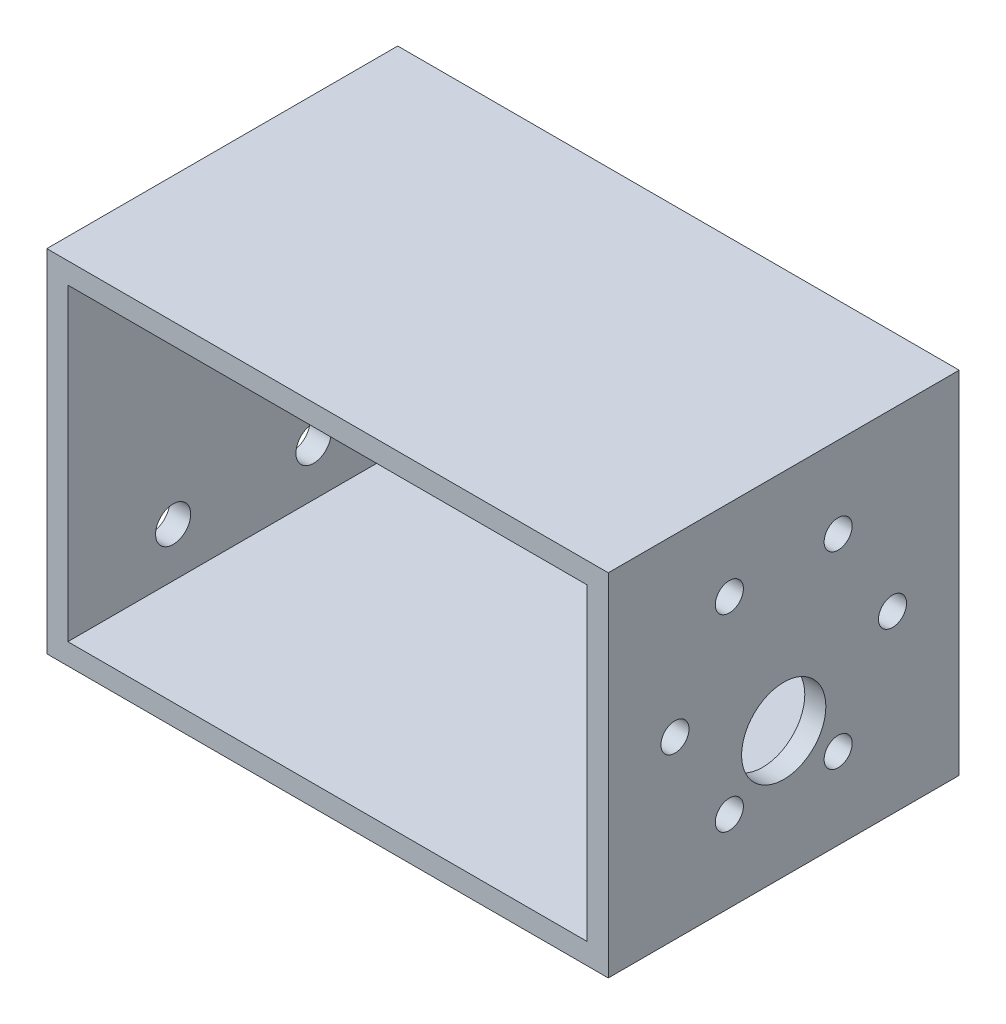
ISO-10303-21;
HEADER;
FILE_DESCRIPTION(('STEP AP214'),'2;1');
FILE_NAME('part.step','',(''),(''),'','','');
FILE_SCHEMA(('AUTOMOTIVE_DESIGN { 1 0 10303 214 1 1 1 1 }'));
ENDSEC;
DATA;
#1=APPLICATION_CONTEXT('core data for automotive mechanical design processes');
#2=APPLICATION_PROTOCOL_DEFINITION('international standard','automotive_design',2000,#1);
#3=PRODUCT_CONTEXT('',#1,'mechanical');
#4=PRODUCT('Part','Part','',(#3));
#5=PRODUCT_RELATED_PRODUCT_CATEGORY('part','',(#4));
#6=PRODUCT_DEFINITION_FORMATION('','',#4);
#7=PRODUCT_DEFINITION_CONTEXT('part definition',#1,'design');
#8=PRODUCT_DEFINITION('design','',#6,#7);
#9=PRODUCT_DEFINITION_SHAPE('','',#8);
#10=(LENGTH_UNIT() NAMED_UNIT(*) SI_UNIT(.MILLI.,.METRE.));
#11=(NAMED_UNIT(*) PLANE_ANGLE_UNIT() SI_UNIT($,.RADIAN.));
#12=(NAMED_UNIT(*) SI_UNIT($,.STERADIAN.) SOLID_ANGLE_UNIT());
#13=UNCERTAINTY_MEASURE_WITH_UNIT(LENGTH_MEASURE(1.E-05),#10,'distance_accuracy_value','');
#14=(GEOMETRIC_REPRESENTATION_CONTEXT(3) GLOBAL_UNCERTAINTY_ASSIGNED_CONTEXT((#13)) GLOBAL_UNIT_ASSIGNED_CONTEXT((#10,
#11,#12)) REPRESENTATION_CONTEXT('',''));
#15=CARTESIAN_POINT('',(0.,0.,0.));
#16=DIRECTION('',(0.,0.,1.));
#17=DIRECTION('',(1.,0.,0.));
#18=AXIS2_PLACEMENT_3D('',#15,#16,#17);
#19=CARTESIAN_POINT('',(0.,0.,-50.));
#20=DIRECTION('',(0.,0.,1.));
#21=DIRECTION('',(1.,0.,0.));
#22=AXIS2_PLACEMENT_3D('',#19,#20,#21);
#23=PLANE('',#22);
#24=DIRECTION('',(0.,1.,0.));
#25=VECTOR('',#24,1.);
#26=CARTESIAN_POINT('',(0.,0.,-50.));
#27=LINE('',#26,#25);
#28=CARTESIAN_POINT('',(0.,-50.,-50.));
#29=VERTEX_POINT('',#28);
#30=CARTESIAN_POINT('',(0.,0.,-50.));
#31=VERTEX_POINT('',#30);
#32=EDGE_CURVE('E135',#29,#31,#27,.T.);
#33=ORIENTED_EDGE('',*,*,#32,.T.);
#34=DIRECTION('',(1.,0.,0.));
#35=VECTOR('',#34,1.);
#36=CARTESIAN_POINT('',(0.,0.,-50.));
#37=LINE('',#36,#35);
#38=CARTESIAN_POINT('',(80.,0.,-50.));
#39=VERTEX_POINT('',#38);
#40=EDGE_CURVE('E138',#31,#39,#37,.T.);
#41=ORIENTED_EDGE('',*,*,#40,.T.);
#42=DIRECTION('',(0.,-1.,0.));
#43=VECTOR('',#42,1.);
#44=CARTESIAN_POINT('',(80.,0.,-50.));
#45=LINE('',#44,#43);
#46=CARTESIAN_POINT('',(80.,-50.,-50.));
#47=VERTEX_POINT('',#46);
#48=EDGE_CURVE('E141',#39,#47,#45,.T.);
#49=ORIENTED_EDGE('',*,*,#48,.T.);
#50=DIRECTION('',(-1.,0.,0.));
#51=VECTOR('',#50,1.);
#52=CARTESIAN_POINT('',(0.,-50.,-50.));
#53=LINE('',#52,#51);
#54=EDGE_CURVE('E143',#47,#29,#53,.T.);
#55=ORIENTED_EDGE('',*,*,#54,.T.);
#56=EDGE_LOOP('',(#33,#41,#49,#55));
#57=FACE_BOUND('',#56,.T.);
#58=DIRECTION('',(0.,1.,0.));
#59=VECTOR('',#58,1.);
#60=CARTESIAN_POINT('',(3.,-3.,-50.));
#61=LINE('',#60,#59);
#62=CARTESIAN_POINT('',(3.,-47.,-50.));
#63=VERTEX_POINT('',#62);
#64=CARTESIAN_POINT('',(3.,-3.,-50.));
#65=VERTEX_POINT('',#64);
#66=EDGE_CURVE('E97',#63,#65,#61,.T.);
#67=ORIENTED_EDGE('',*,*,#66,.F.);
#68=DIRECTION('',(-1.,0.,0.));
#69=VECTOR('',#68,1.);
#70=CARTESIAN_POINT('',(3.,-47.,-50.));
#71=LINE('',#70,#69);
#72=CARTESIAN_POINT('',(77.,-47.,-50.));
#73=VERTEX_POINT('',#72);
#74=EDGE_CURVE('E119',#73,#63,#71,.T.);
#75=ORIENTED_EDGE('',*,*,#74,.F.);
#76=DIRECTION('',(0.,-1.,0.));
#77=VECTOR('',#76,1.);
#78=CARTESIAN_POINT('',(77.,-3.,-50.));
#79=LINE('',#78,#77);
#80=CARTESIAN_POINT('',(77.,-3.,-50.));
#81=VERTEX_POINT('',#80);
#82=EDGE_CURVE('E117',#81,#73,#79,.T.);
#83=ORIENTED_EDGE('',*,*,#82,.F.);
#84=DIRECTION('',(1.,0.,0.));
#85=VECTOR('',#84,1.);
#86=CARTESIAN_POINT('',(3.,-3.,-50.));
#87=LINE('',#86,#85);
#88=EDGE_CURVE('E105',#65,#81,#87,.T.);
#89=ORIENTED_EDGE('',*,*,#88,.F.);
#90=EDGE_LOOP('',(#67,#75,#83,#89));
#91=FACE_BOUND('',#90,.T.);
#92=ADVANCED_FACE('F32',(#57,#91),#23,.F.);
#93=CARTESIAN_POINT('',(0.,0.,0.));
#94=DIRECTION('',(0.,0.,1.));
#95=DIRECTION('',(1.,0.,0.));
#96=AXIS2_PLACEMENT_3D('',#93,#94,#95);
#97=PLANE('',#96);
#98=DIRECTION('',(0.,1.,0.));
#99=VECTOR('',#98,1.);
#100=CARTESIAN_POINT('',(0.,0.,0.));
#101=LINE('',#100,#99);
#102=CARTESIAN_POINT('',(0.,-50.,0.));
#103=VERTEX_POINT('',#102);
#104=CARTESIAN_POINT('',(0.,0.,0.));
#105=VERTEX_POINT('',#104);
#106=EDGE_CURVE('E113',#103,#105,#101,.T.);
#107=ORIENTED_EDGE('',*,*,#106,.F.);
#108=DIRECTION('',(-1.,0.,0.));
#109=VECTOR('',#108,1.);
#110=CARTESIAN_POINT('',(0.,-50.,0.));
#111=LINE('',#110,#109);
#112=CARTESIAN_POINT('',(80.,-50.,0.));
#113=VERTEX_POINT('',#112);
#114=EDGE_CURVE('E139',#113,#103,#111,.T.);
#115=ORIENTED_EDGE('',*,*,#114,.F.);
#116=DIRECTION('',(0.,-1.,0.));
#117=VECTOR('',#116,1.);
#118=CARTESIAN_POINT('',(80.,0.,0.));
#119=LINE('',#118,#117);
#120=CARTESIAN_POINT('',(80.,0.,0.));
#121=VERTEX_POINT('',#120);
#122=EDGE_CURVE('E150',#121,#113,#119,.T.);
#123=ORIENTED_EDGE('',*,*,#122,.F.);
#124=DIRECTION('',(1.,0.,0.));
#125=VECTOR('',#124,1.);
#126=CARTESIAN_POINT('',(0.,0.,0.));
#127=LINE('',#126,#125);
#128=EDGE_CURVE('E148',#105,#121,#127,.T.);
#129=ORIENTED_EDGE('',*,*,#128,.F.);
#130=EDGE_LOOP('',(#107,#115,#123,#129));
#131=FACE_BOUND('',#130,.T.);
#132=DIRECTION('',(-1.,0.,0.));
#133=VECTOR('',#132,1.);
#134=CARTESIAN_POINT('',(3.,-47.,0.));
#135=LINE('',#134,#133);
#136=CARTESIAN_POINT('',(77.,-47.,0.));
#137=VERTEX_POINT('',#136);
#138=CARTESIAN_POINT('',(3.,-47.,0.));
#139=VERTEX_POINT('',#138);
#140=EDGE_CURVE('E106',#137,#139,#135,.T.);
#141=ORIENTED_EDGE('',*,*,#140,.T.);
#142=DIRECTION('',(0.,1.,0.));
#143=VECTOR('',#142,1.);
#144=CARTESIAN_POINT('',(3.,-3.,0.));
#145=LINE('',#144,#143);
#146=CARTESIAN_POINT('',(3.,-3.,0.));
#147=VERTEX_POINT('',#146);
#148=EDGE_CURVE('E55',#139,#147,#145,.T.);
#149=ORIENTED_EDGE('',*,*,#148,.T.);
#150=DIRECTION('',(1.,0.,0.));
#151=VECTOR('',#150,1.);
#152=CARTESIAN_POINT('',(3.,-3.,0.));
#153=LINE('',#152,#151);
#154=CARTESIAN_POINT('',(77.,-3.,0.));
#155=VERTEX_POINT('',#154);
#156=EDGE_CURVE('E112',#147,#155,#153,.T.);
#157=ORIENTED_EDGE('',*,*,#156,.T.);
#158=DIRECTION('',(0.,-1.,0.));
#159=VECTOR('',#158,1.);
#160=CARTESIAN_POINT('',(77.,-3.,0.));
#161=LINE('',#160,#159);
#162=EDGE_CURVE('E127',#155,#137,#161,.T.);
#163=ORIENTED_EDGE('',*,*,#162,.T.);
#164=EDGE_LOOP('',(#141,#149,#157,#163));
#165=FACE_BOUND('',#164,.T.);
#166=ADVANCED_FACE('F168',(#131,#165),#97,.T.);
#167=CARTESIAN_POINT('',(0.,0.,-50.));
#168=DIRECTION('',(1.,0.,0.));
#169=DIRECTION('',(0.,0.,-1.));
#170=AXIS2_PLACEMENT_3D('',#167,#168,#169);
#171=PLANE('',#170);
#172=CARTESIAN_POINT('',(0.,-10.0000000000001,-14.9999999999999));
#173=DIRECTION('',(1.,0.,0.));
#174=DIRECTION('',(0.,0.,-1.));
#175=AXIS2_PLACEMENT_3D('',#172,#173,#174);
#176=CIRCLE('',#175,2.5);
#177=CARTESIAN_POINT('',(0.,-10.0000000000001,-17.4999999999999));
#178=VERTEX_POINT('',#177);
#179=EDGE_CURVE('E222',#178,#178,#176,.F.);
#180=ORIENTED_EDGE('',*,*,#179,.F.);
#181=EDGE_LOOP('',(#180));
#182=FACE_BOUND('',#181,.T.);
#183=CARTESIAN_POINT('',(0.,-10.,-34.9999999999999));
#184=DIRECTION('',(1.,0.,0.));
#185=DIRECTION('',(0.,0.,-1.));
#186=AXIS2_PLACEMENT_3D('',#183,#184,#185);
#187=CIRCLE('',#186,2.5);
#188=CARTESIAN_POINT('',(0.,-10.,-37.4999999999999));
#189=VERTEX_POINT('',#188);
#190=EDGE_CURVE('E351',#189,#189,#187,.F.);
#191=ORIENTED_EDGE('',*,*,#190,.F.);
#192=EDGE_LOOP('',(#191));
#193=FACE_BOUND('',#192,.T.);
#194=CARTESIAN_POINT('',(0.,-40.,-35.));
#195=DIRECTION('',(1.,0.,0.));
#196=DIRECTION('',(0.,0.,-1.));
#197=AXIS2_PLACEMENT_3D('',#194,#195,#196);
#198=CIRCLE('',#197,2.5);
#199=CARTESIAN_POINT('',(0.,-40.,-37.5));
#200=VERTEX_POINT('',#199);
#201=EDGE_CURVE('E230',#200,#200,#198,.F.);
#202=ORIENTED_EDGE('',*,*,#201,.F.);
#203=EDGE_LOOP('',(#202));
#204=FACE_BOUND('',#203,.T.);
#205=CARTESIAN_POINT('',(0.,-40.0000000000001,-15.));
#206=DIRECTION('',(1.,0.,0.));
#207=DIRECTION('',(0.,0.,-1.));
#208=AXIS2_PLACEMENT_3D('',#205,#206,#207);
#209=CIRCLE('',#208,2.5);
#210=CARTESIAN_POINT('',(0.,-40.0000000000001,-17.5));
#211=VERTEX_POINT('',#210);
#212=EDGE_CURVE('E221',#211,#211,#209,.F.);
#213=ORIENTED_EDGE('',*,*,#212,.F.);
#214=EDGE_LOOP('',(#213));
#215=FACE_BOUND('',#214,.T.);
#216=ORIENTED_EDGE('',*,*,#106,.T.);
#217=DIRECTION('',(0.,0.,1.));
#218=VECTOR('',#217,1.);
#219=CARTESIAN_POINT('',(0.,0.,-50.));
#220=LINE('',#219,#218);
#221=EDGE_CURVE('E11',#31,#105,#220,.T.);
#222=ORIENTED_EDGE('',*,*,#221,.F.);
#223=ORIENTED_EDGE('',*,*,#32,.F.);
#224=DIRECTION('',(0.,0.,1.));
#225=VECTOR('',#224,1.);
#226=CARTESIAN_POINT('',(0.,-50.,-50.));
#227=LINE('',#226,#225);
#228=EDGE_CURVE('E145',#29,#103,#227,.T.);
#229=ORIENTED_EDGE('',*,*,#228,.T.);
#230=EDGE_LOOP('',(#216,#222,#223,#229));
#231=FACE_BOUND('',#230,.T.);
#232=ADVANCED_FACE('F34',(#182,#193,#204,#215,#231),#171,.F.);
#233=CARTESIAN_POINT('',(0.,0.,-50.));
#234=DIRECTION('',(0.,-1.,0.));
#235=DIRECTION('',(0.,0.,-1.));
#236=AXIS2_PLACEMENT_3D('',#233,#234,#235);
#237=PLANE('',#236);
#238=ORIENTED_EDGE('',*,*,#128,.T.);
#239=DIRECTION('',(0.,0.,1.));
#240=VECTOR('',#239,1.);
#241=CARTESIAN_POINT('',(80.,0.,-50.));
#242=LINE('',#241,#240);
#243=EDGE_CURVE('E40',#39,#121,#242,.T.);
#244=ORIENTED_EDGE('',*,*,#243,.F.);
#245=ORIENTED_EDGE('',*,*,#40,.F.);
#246=ORIENTED_EDGE('',*,*,#221,.T.);
#247=EDGE_LOOP('',(#238,#244,#245,#246));
#248=FACE_BOUND('',#247,.T.);
#249=ADVANCED_FACE('F178',(#248),#237,.F.);
#250=CARTESIAN_POINT('',(80.,0.,-50.));
#251=DIRECTION('',(-1.,0.,0.));
#252=DIRECTION('',(0.,0.,1.));
#253=AXIS2_PLACEMENT_3D('',#250,#251,#252);
#254=PLANE('',#253);
#255=CARTESIAN_POINT('',(80.,-11.5766062413412,-17.25));
#256=DIRECTION('',(1.,0.,0.));
#257=DIRECTION('',(0.,0.,-1.));
#258=AXIS2_PLACEMENT_3D('',#255,#256,#257);
#259=CIRCLE('',#258,2.);
#260=CARTESIAN_POINT('',(80.,-11.5766062413412,-19.25));
#261=VERTEX_POINT('',#260);
#262=EDGE_CURVE('E225',#261,#261,#259,.T.);
#263=ORIENTED_EDGE('',*,*,#262,.F.);
#264=EDGE_LOOP('',(#263));
#265=FACE_BOUND('',#264,.T.);
#266=CARTESIAN_POINT('',(80.,-11.5766062413412,-32.75));
#267=DIRECTION('',(1.,0.,0.));
#268=DIRECTION('',(0.,0.,-1.));
#269=AXIS2_PLACEMENT_3D('',#266,#267,#268);
#270=CIRCLE('',#269,2.);
#271=CARTESIAN_POINT('',(80.,-11.5766062413412,-34.75));
#272=VERTEX_POINT('',#271);
#273=EDGE_CURVE('E241',#272,#272,#270,.T.);
#274=ORIENTED_EDGE('',*,*,#273,.F.);
#275=EDGE_LOOP('',(#274));
#276=FACE_BOUND('',#275,.T.);
#277=CARTESIAN_POINT('',(80.,-25.,-40.5));
#278=DIRECTION('',(1.,0.,0.));
#279=DIRECTION('',(0.,0.,-1.));
#280=AXIS2_PLACEMENT_3D('',#277,#278,#279);
#281=CIRCLE('',#280,2.);
#282=CARTESIAN_POINT('',(80.,-25.,-42.5));
#283=VERTEX_POINT('',#282);
#284=EDGE_CURVE('E233',#283,#283,#281,.T.);
#285=ORIENTED_EDGE('',*,*,#284,.F.);
#286=EDGE_LOOP('',(#285));
#287=FACE_BOUND('',#286,.T.);
#288=CARTESIAN_POINT('',(80.,-32.,-25.));
#289=DIRECTION('',(1.,0.,0.));
#290=DIRECTION('',(0.,0.,-1.));
#291=AXIS2_PLACEMENT_3D('',#288,#289,#290);
#292=CIRCLE('',#291,5.99999999999999);
#293=CARTESIAN_POINT('',(80.,-32.,-31.));
#294=VERTEX_POINT('',#293);
#295=EDGE_CURVE('E258',#294,#294,#292,.T.);
#296=ORIENTED_EDGE('',*,*,#295,.F.);
#297=EDGE_LOOP('',(#296));
#298=FACE_BOUND('',#297,.T.);
#299=CARTESIAN_POINT('',(80.,-38.4233937586588,-17.25));
#300=DIRECTION('',(1.,0.,0.));
#301=DIRECTION('',(0.,0.,-1.));
#302=AXIS2_PLACEMENT_3D('',#299,#300,#301);
#303=CIRCLE('',#302,2.);
#304=CARTESIAN_POINT('',(80.,-38.4233937586588,-19.25));
#305=VERTEX_POINT('',#304);
#306=EDGE_CURVE('E251',#305,#305,#303,.T.);
#307=ORIENTED_EDGE('',*,*,#306,.F.);
#308=EDGE_LOOP('',(#307));
#309=FACE_BOUND('',#308,.T.);
#310=CARTESIAN_POINT('',(80.,-38.4233937586588,-32.75));
#311=DIRECTION('',(1.,0.,0.));
#312=DIRECTION('',(0.,0.,-1.));
#313=AXIS2_PLACEMENT_3D('',#310,#311,#312);
#314=CIRCLE('',#313,2.);
#315=CARTESIAN_POINT('',(80.,-38.4233937586588,-34.75));
#316=VERTEX_POINT('',#315);
#317=EDGE_CURVE('E240',#316,#316,#314,.T.);
#318=ORIENTED_EDGE('',*,*,#317,.F.);
#319=EDGE_LOOP('',(#318));
#320=FACE_BOUND('',#319,.T.);
#321=CARTESIAN_POINT('',(80.,-25.,-9.5));
#322=DIRECTION('',(1.,0.,0.));
#323=DIRECTION('',(0.,0.,-1.));
#324=AXIS2_PLACEMENT_3D('',#321,#322,#323);
#325=CIRCLE('',#324,2.);
#326=CARTESIAN_POINT('',(80.,-25.,-11.5));
#327=VERTEX_POINT('',#326);
#328=EDGE_CURVE('E268',#327,#327,#325,.T.);
#329=ORIENTED_EDGE('',*,*,#328,.F.);
#330=EDGE_LOOP('',(#329));
#331=FACE_BOUND('',#330,.T.);
#332=ORIENTED_EDGE('',*,*,#122,.T.);
#333=DIRECTION('',(0.,0.,1.));
#334=VECTOR('',#333,1.);
#335=CARTESIAN_POINT('',(80.,-50.,-50.));
#336=LINE('',#335,#334);
#337=EDGE_CURVE('E155',#47,#113,#336,.T.);
#338=ORIENTED_EDGE('',*,*,#337,.F.);
#339=ORIENTED_EDGE('',*,*,#48,.F.);
#340=ORIENTED_EDGE('',*,*,#243,.T.);
#341=EDGE_LOOP('',(#332,#338,#339,#340));
#342=FACE_BOUND('',#341,.T.);
#343=ADVANCED_FACE('F162',(#265,#276,#287,#298,#309,#320,#331,#342),#254,.F.);
#344=CARTESIAN_POINT('',(0.,-50.,-50.));
#345=DIRECTION('',(0.,1.,0.));
#346=DIRECTION('',(0.,0.,1.));
#347=AXIS2_PLACEMENT_3D('',#344,#345,#346);
#348=PLANE('',#347);
#349=ORIENTED_EDGE('',*,*,#114,.T.);
#350=ORIENTED_EDGE('',*,*,#228,.F.);
#351=ORIENTED_EDGE('',*,*,#54,.F.);
#352=ORIENTED_EDGE('',*,*,#337,.T.);
#353=EDGE_LOOP('',(#349,#350,#351,#352));
#354=FACE_BOUND('',#353,.T.);
#355=ADVANCED_FACE('F172',(#354),#348,.F.);
#356=CARTESIAN_POINT('',(3.,-3.,-50.));
#357=DIRECTION('',(1.,0.,0.));
#358=DIRECTION('',(0.,0.,-1.));
#359=AXIS2_PLACEMENT_3D('',#356,#357,#358);
#360=PLANE('',#359);
#361=CARTESIAN_POINT('',(3.,-10.0000000000001,-14.9999999999999));
#362=DIRECTION('',(1.,0.,0.));
#363=DIRECTION('',(0.,0.,-1.));
#364=AXIS2_PLACEMENT_3D('',#361,#362,#363);
#365=CIRCLE('',#364,2.5);
#366=CARTESIAN_POINT('',(3.,-10.0000000000001,-17.4999999999999));
#367=VERTEX_POINT('',#366);
#368=EDGE_CURVE('E208',#367,#367,#365,.T.);
#369=ORIENTED_EDGE('',*,*,#368,.F.);
#370=EDGE_LOOP('',(#369));
#371=FACE_BOUND('',#370,.T.);
#372=CARTESIAN_POINT('',(3.,-10.,-34.9999999999999));
#373=DIRECTION('',(1.,0.,0.));
#374=DIRECTION('',(0.,0.,-1.));
#375=AXIS2_PLACEMENT_3D('',#372,#373,#374);
#376=CIRCLE('',#375,2.5);
#377=CARTESIAN_POINT('',(3.,-10.,-37.4999999999999));
#378=VERTEX_POINT('',#377);
#379=EDGE_CURVE('E212',#378,#378,#376,.T.);
#380=ORIENTED_EDGE('',*,*,#379,.F.);
#381=EDGE_LOOP('',(#380));
#382=FACE_BOUND('',#381,.T.);
#383=CARTESIAN_POINT('',(3.,-40.,-35.));
#384=DIRECTION('',(1.,0.,0.));
#385=DIRECTION('',(0.,0.,-1.));
#386=AXIS2_PLACEMENT_3D('',#383,#384,#385);
#387=CIRCLE('',#386,2.5);
#388=CARTESIAN_POINT('',(3.,-40.,-37.5));
#389=VERTEX_POINT('',#388);
#390=EDGE_CURVE('E216',#389,#389,#387,.T.);
#391=ORIENTED_EDGE('',*,*,#390,.F.);
#392=EDGE_LOOP('',(#391));
#393=FACE_BOUND('',#392,.T.);
#394=CARTESIAN_POINT('',(3.,-40.0000000000001,-15.));
#395=DIRECTION('',(1.,0.,0.));
#396=DIRECTION('',(0.,0.,-1.));
#397=AXIS2_PLACEMENT_3D('',#394,#395,#396);
#398=CIRCLE('',#397,2.5);
#399=CARTESIAN_POINT('',(3.,-40.0000000000001,-17.5));
#400=VERTEX_POINT('',#399);
#401=EDGE_CURVE('E219',#400,#400,#398,.T.);
#402=ORIENTED_EDGE('',*,*,#401,.F.);
#403=EDGE_LOOP('',(#402));
#404=FACE_BOUND('',#403,.T.);
#405=ORIENTED_EDGE('',*,*,#148,.F.);
#406=DIRECTION('',(0.,0.,1.));
#407=VECTOR('',#406,1.);
#408=CARTESIAN_POINT('',(3.,-47.,-50.));
#409=LINE('',#408,#407);
#410=EDGE_CURVE('E101',#63,#139,#409,.T.);
#411=ORIENTED_EDGE('',*,*,#410,.F.);
#412=ORIENTED_EDGE('',*,*,#66,.T.);
#413=DIRECTION('',(0.,0.,1.));
#414=VECTOR('',#413,1.);
#415=CARTESIAN_POINT('',(3.,-3.,-50.));
#416=LINE('',#415,#414);
#417=EDGE_CURVE('E100',#65,#147,#416,.T.);
#418=ORIENTED_EDGE('',*,*,#417,.T.);
#419=EDGE_LOOP('',(#405,#411,#412,#418));
#420=FACE_BOUND('',#419,.T.);
#421=ADVANCED_FACE('F99',(#371,#382,#393,#404,#420),#360,.T.);
#422=CARTESIAN_POINT('',(3.,-3.,-50.));
#423=DIRECTION('',(0.,-1.,0.));
#424=DIRECTION('',(0.,0.,-1.));
#425=AXIS2_PLACEMENT_3D('',#422,#423,#424);
#426=PLANE('',#425);
#427=ORIENTED_EDGE('',*,*,#156,.F.);
#428=ORIENTED_EDGE('',*,*,#417,.F.);
#429=ORIENTED_EDGE('',*,*,#88,.T.);
#430=DIRECTION('',(0.,0.,1.));
#431=VECTOR('',#430,1.);
#432=CARTESIAN_POINT('',(77.,-3.,-50.));
#433=LINE('',#432,#431);
#434=EDGE_CURVE('E114',#81,#155,#433,.T.);
#435=ORIENTED_EDGE('',*,*,#434,.T.);
#436=EDGE_LOOP('',(#427,#428,#429,#435));
#437=FACE_BOUND('',#436,.T.);
#438=ADVANCED_FACE('F109',(#437),#426,.T.);
#439=CARTESIAN_POINT('',(77.,-3.,-50.));
#440=DIRECTION('',(-1.,0.,0.));
#441=DIRECTION('',(0.,0.,1.));
#442=AXIS2_PLACEMENT_3D('',#439,#440,#441);
#443=PLANE('',#442);
#444=CARTESIAN_POINT('',(77.,-11.5766062413412,-17.25));
#445=DIRECTION('',(-1.,0.,0.));
#446=DIRECTION('',(0.,0.,1.));
#447=AXIS2_PLACEMENT_3D('',#444,#445,#446);
#448=CIRCLE('',#447,2.);
#449=CARTESIAN_POINT('',(77.,-11.5766062413412,-15.25));
#450=VERTEX_POINT('',#449);
#451=EDGE_CURVE('E244',#450,#450,#448,.F.);
#452=ORIENTED_EDGE('',*,*,#451,.T.);
#453=EDGE_LOOP('',(#452));
#454=FACE_BOUND('',#453,.T.);
#455=CARTESIAN_POINT('',(77.,-11.5766062413412,-32.75));
#456=DIRECTION('',(-1.,0.,0.));
#457=DIRECTION('',(0.,0.,1.));
#458=AXIS2_PLACEMENT_3D('',#455,#456,#457);
#459=CIRCLE('',#458,2.);
#460=CARTESIAN_POINT('',(77.,-11.5766062413412,-30.75));
#461=VERTEX_POINT('',#460);
#462=EDGE_CURVE('E237',#461,#461,#459,.F.);
#463=ORIENTED_EDGE('',*,*,#462,.T.);
#464=EDGE_LOOP('',(#463));
#465=FACE_BOUND('',#464,.T.);
#466=CARTESIAN_POINT('',(77.,-25.,-40.5));
#467=DIRECTION('',(-1.,0.,0.));
#468=DIRECTION('',(0.,0.,1.));
#469=AXIS2_PLACEMENT_3D('',#466,#467,#468);
#470=CIRCLE('',#469,2.);
#471=CARTESIAN_POINT('',(77.,-25.,-38.5));
#472=VERTEX_POINT('',#471);
#473=EDGE_CURVE('E236',#472,#472,#470,.F.);
#474=ORIENTED_EDGE('',*,*,#473,.T.);
#475=EDGE_LOOP('',(#474));
#476=FACE_BOUND('',#475,.T.);
#477=CARTESIAN_POINT('',(77.,-32.,-25.));
#478=DIRECTION('',(-1.,0.,0.));
#479=DIRECTION('',(0.,0.,1.));
#480=AXIS2_PLACEMENT_3D('',#477,#478,#479);
#481=CIRCLE('',#480,5.99999999999999);
#482=CARTESIAN_POINT('',(77.,-32.,-19.));
#483=VERTEX_POINT('',#482);
#484=EDGE_CURVE('E265',#483,#483,#481,.F.);
#485=ORIENTED_EDGE('',*,*,#484,.T.);
#486=EDGE_LOOP('',(#485));
#487=FACE_BOUND('',#486,.T.);
#488=CARTESIAN_POINT('',(77.,-38.4233937586588,-17.25));
#489=DIRECTION('',(-1.,0.,0.));
#490=DIRECTION('',(0.,0.,1.));
#491=AXIS2_PLACEMENT_3D('',#488,#489,#490);
#492=CIRCLE('',#491,2.);
#493=CARTESIAN_POINT('',(77.,-38.4233937586588,-15.25));
#494=VERTEX_POINT('',#493);
#495=EDGE_CURVE('E254',#494,#494,#492,.F.);
#496=ORIENTED_EDGE('',*,*,#495,.T.);
#497=EDGE_LOOP('',(#496));
#498=FACE_BOUND('',#497,.T.);
#499=CARTESIAN_POINT('',(77.,-38.4233937586588,-32.75));
#500=DIRECTION('',(-1.,0.,0.));
#501=DIRECTION('',(0.,0.,1.));
#502=AXIS2_PLACEMENT_3D('',#499,#500,#501);
#503=CIRCLE('',#502,2.);
#504=CARTESIAN_POINT('',(77.,-38.4233937586588,-30.75));
#505=VERTEX_POINT('',#504);
#506=EDGE_CURVE('E255',#505,#505,#503,.F.);
#507=ORIENTED_EDGE('',*,*,#506,.T.);
#508=EDGE_LOOP('',(#507));
#509=FACE_BOUND('',#508,.T.);
#510=CARTESIAN_POINT('',(77.,-25.,-9.5));
#511=DIRECTION('',(-1.,0.,0.));
#512=DIRECTION('',(0.,0.,1.));
#513=AXIS2_PLACEMENT_3D('',#510,#511,#512);
#514=CIRCLE('',#513,2.);
#515=CARTESIAN_POINT('',(77.,-25.,-7.49999999999999));
#516=VERTEX_POINT('',#515);
#517=EDGE_CURVE('E125',#516,#516,#514,.F.);
#518=ORIENTED_EDGE('',*,*,#517,.T.);
#519=EDGE_LOOP('',(#518));
#520=FACE_BOUND('',#519,.T.);
#521=ORIENTED_EDGE('',*,*,#162,.F.);
#522=ORIENTED_EDGE('',*,*,#434,.F.);
#523=ORIENTED_EDGE('',*,*,#82,.T.);
#524=DIRECTION('',(0.,0.,1.));
#525=VECTOR('',#524,1.);
#526=CARTESIAN_POINT('',(77.,-47.,-50.));
#527=LINE('',#526,#525);
#528=EDGE_CURVE('E47',#73,#137,#527,.T.);
#529=ORIENTED_EDGE('',*,*,#528,.T.);
#530=EDGE_LOOP('',(#521,#522,#523,#529));
#531=FACE_BOUND('',#530,.T.);
#532=ADVANCED_FACE('F204',(#454,#465,#476,#487,#498,#509,#520,#531),#443,.T.);
#533=CARTESIAN_POINT('',(3.,-47.,-50.));
#534=DIRECTION('',(0.,1.,0.));
#535=DIRECTION('',(0.,0.,1.));
#536=AXIS2_PLACEMENT_3D('',#533,#534,#535);
#537=PLANE('',#536);
#538=ORIENTED_EDGE('',*,*,#140,.F.);
#539=ORIENTED_EDGE('',*,*,#528,.F.);
#540=ORIENTED_EDGE('',*,*,#74,.T.);
#541=ORIENTED_EDGE('',*,*,#410,.T.);
#542=EDGE_LOOP('',(#538,#539,#540,#541));
#543=FACE_BOUND('',#542,.T.);
#544=ADVANCED_FACE('F278',(#543),#537,.T.);
#545=CARTESIAN_POINT('',(60.0294372515229,-25.,-9.5));
#546=DIRECTION('',(1.,0.,0.));
#547=DIRECTION('',(0.,0.,-1.));
#548=AXIS2_PLACEMENT_3D('',#545,#546,#547);
#549=CYLINDRICAL_SURFACE('',#548,2.);
#550=ORIENTED_EDGE('',*,*,#328,.T.);
#551=EDGE_LOOP('',(#550));
#552=FACE_BOUND('',#551,.T.);
#553=ORIENTED_EDGE('',*,*,#517,.F.);
#554=EDGE_LOOP('',(#553));
#555=FACE_BOUND('',#554,.T.);
#556=ADVANCED_FACE('F275',(#552,#555),#549,.F.);
#557=CARTESIAN_POINT('',(60.0294372515229,-38.4233937586588,-32.75));
#558=DIRECTION('',(1.,0.,0.));
#559=DIRECTION('',(0.,0.,-1.));
#560=AXIS2_PLACEMENT_3D('',#557,#558,#559);
#561=CYLINDRICAL_SURFACE('',#560,2.);
#562=ORIENTED_EDGE('',*,*,#317,.T.);
#563=EDGE_LOOP('',(#562));
#564=FACE_BOUND('',#563,.T.);
#565=ORIENTED_EDGE('',*,*,#506,.F.);
#566=EDGE_LOOP('',(#565));
#567=FACE_BOUND('',#566,.T.);
#568=ADVANCED_FACE('F277',(#564,#567),#561,.F.);
#569=CARTESIAN_POINT('',(60.0294372515229,-38.4233937586588,-17.25));
#570=DIRECTION('',(1.,0.,0.));
#571=DIRECTION('',(0.,0.,-1.));
#572=AXIS2_PLACEMENT_3D('',#569,#570,#571);
#573=CYLINDRICAL_SURFACE('',#572,2.);
#574=ORIENTED_EDGE('',*,*,#306,.T.);
#575=EDGE_LOOP('',(#574));
#576=FACE_BOUND('',#575,.T.);
#577=ORIENTED_EDGE('',*,*,#495,.F.);
#578=EDGE_LOOP('',(#577));
#579=FACE_BOUND('',#578,.T.);
#580=ADVANCED_FACE('F285',(#576,#579),#573,.F.);
#581=CARTESIAN_POINT('',(60.0294372515229,-32.,-25.));
#582=DIRECTION('',(1.,0.,0.));
#583=DIRECTION('',(0.,0.,-1.));
#584=AXIS2_PLACEMENT_3D('',#581,#582,#583);
#585=CYLINDRICAL_SURFACE('',#584,5.99999999999999);
#586=ORIENTED_EDGE('',*,*,#295,.T.);
#587=EDGE_LOOP('',(#586));
#588=FACE_BOUND('',#587,.T.);
#589=ORIENTED_EDGE('',*,*,#484,.F.);
#590=EDGE_LOOP('',(#589));
#591=FACE_BOUND('',#590,.T.);
#592=ADVANCED_FACE('F290',(#588,#591),#585,.F.);
#593=CARTESIAN_POINT('',(60.0294372515229,-25.,-40.5));
#594=DIRECTION('',(1.,0.,0.));
#595=DIRECTION('',(0.,0.,-1.));
#596=AXIS2_PLACEMENT_3D('',#593,#594,#595);
#597=CYLINDRICAL_SURFACE('',#596,2.);
#598=ORIENTED_EDGE('',*,*,#284,.T.);
#599=EDGE_LOOP('',(#598));
#600=FACE_BOUND('',#599,.T.);
#601=ORIENTED_EDGE('',*,*,#473,.F.);
#602=EDGE_LOOP('',(#601));
#603=FACE_BOUND('',#602,.T.);
#604=ADVANCED_FACE('F315',(#600,#603),#597,.F.);
#605=CARTESIAN_POINT('',(60.0294372515229,-11.5766062413412,-32.75));
#606=DIRECTION('',(1.,0.,0.));
#607=DIRECTION('',(0.,0.,-1.));
#608=AXIS2_PLACEMENT_3D('',#605,#606,#607);
#609=CYLINDRICAL_SURFACE('',#608,2.);
#610=ORIENTED_EDGE('',*,*,#273,.T.);
#611=EDGE_LOOP('',(#610));
#612=FACE_BOUND('',#611,.T.);
#613=ORIENTED_EDGE('',*,*,#462,.F.);
#614=EDGE_LOOP('',(#613));
#615=FACE_BOUND('',#614,.T.);
#616=ADVANCED_FACE('F322',(#612,#615),#609,.F.);
#617=CARTESIAN_POINT('',(60.0294372515229,-11.5766062413412,-17.25));
#618=DIRECTION('',(1.,0.,0.));
#619=DIRECTION('',(0.,0.,-1.));
#620=AXIS2_PLACEMENT_3D('',#617,#618,#619);
#621=CYLINDRICAL_SURFACE('',#620,2.);
#622=ORIENTED_EDGE('',*,*,#262,.T.);
#623=EDGE_LOOP('',(#622));
#624=FACE_BOUND('',#623,.T.);
#625=ORIENTED_EDGE('',*,*,#451,.F.);
#626=EDGE_LOOP('',(#625));
#627=FACE_BOUND('',#626,.T.);
#628=ADVANCED_FACE('F318',(#624,#627),#621,.F.);
#629=CARTESIAN_POINT('',(-0.00100000000000013,-40.0000000000001,-15.));
#630=DIRECTION('',(1.,0.,0.));
#631=DIRECTION('',(0.,0.,-1.));
#632=AXIS2_PLACEMENT_3D('',#629,#630,#631);
#633=CYLINDRICAL_SURFACE('',#632,2.5);
#634=ORIENTED_EDGE('',*,*,#401,.T.);
#635=EDGE_LOOP('',(#634));
#636=FACE_BOUND('',#635,.T.);
#637=ORIENTED_EDGE('',*,*,#212,.T.);
#638=EDGE_LOOP('',(#637));
#639=FACE_BOUND('',#638,.T.);
#640=ADVANCED_FACE('F321',(#636,#639),#633,.F.);
#641=CARTESIAN_POINT('',(-0.00100000000000013,-40.,-35.));
#642=DIRECTION('',(1.,0.,0.));
#643=DIRECTION('',(0.,0.,-1.));
#644=AXIS2_PLACEMENT_3D('',#641,#642,#643);
#645=CYLINDRICAL_SURFACE('',#644,2.5);
#646=ORIENTED_EDGE('',*,*,#390,.T.);
#647=EDGE_LOOP('',(#646));
#648=FACE_BOUND('',#647,.T.);
#649=ORIENTED_EDGE('',*,*,#201,.T.);
#650=EDGE_LOOP('',(#649));
#651=FACE_BOUND('',#650,.T.);
#652=ADVANCED_FACE('F332',(#648,#651),#645,.F.);
#653=CARTESIAN_POINT('',(-0.00100000000000013,-10.,-34.9999999999999));
#654=DIRECTION('',(1.,0.,0.));
#655=DIRECTION('',(0.,0.,-1.));
#656=AXIS2_PLACEMENT_3D('',#653,#654,#655);
#657=CYLINDRICAL_SURFACE('',#656,2.5);
#658=ORIENTED_EDGE('',*,*,#379,.T.);
#659=EDGE_LOOP('',(#658));
#660=FACE_BOUND('',#659,.T.);
#661=ORIENTED_EDGE('',*,*,#190,.T.);
#662=EDGE_LOOP('',(#661));
#663=FACE_BOUND('',#662,.T.);
#664=ADVANCED_FACE('F335',(#660,#663),#657,.F.);
#665=CARTESIAN_POINT('',(-0.00100000000000013,-10.0000000000001,-14.9999999999999));
#666=DIRECTION('',(1.,0.,0.));
#667=DIRECTION('',(0.,0.,-1.));
#668=AXIS2_PLACEMENT_3D('',#665,#666,#667);
#669=CYLINDRICAL_SURFACE('',#668,2.5);
#670=ORIENTED_EDGE('',*,*,#368,.T.);
#671=EDGE_LOOP('',(#670));
#672=FACE_BOUND('',#671,.T.);
#673=ORIENTED_EDGE('',*,*,#179,.T.);
#674=EDGE_LOOP('',(#673));
#675=FACE_BOUND('',#674,.T.);
#676=ADVANCED_FACE('F339',(#672,#675),#669,.F.);
#677=CLOSED_SHELL('',(#92,#166,#232,#249,#343,#355,#421,#438,#532,#544,#556,#568,#580,#592,#604,
#616,#628,#640,#652,#664,#676));
#678=MANIFOLD_SOLID_BREP('B2',#677);
#679=ADVANCED_BREP_SHAPE_REPRESENTATION('',(#18,#678),#14);
#680=SHAPE_DEFINITION_REPRESENTATION(#9,#679);
ENDSEC;
END-ISO-10303-21;
